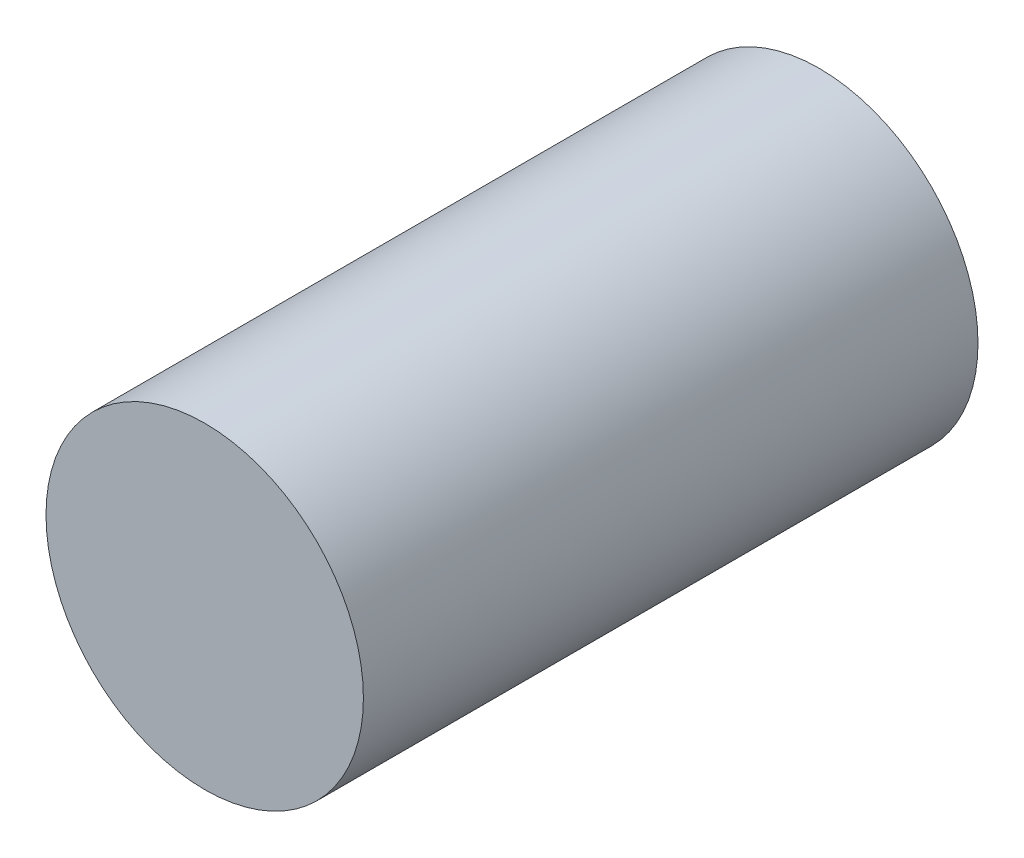
ISO-10303-21;
HEADER;
FILE_DESCRIPTION(('STEP AP214'),'2;1');
FILE_NAME('part.step','',(''),(''),'','','');
FILE_SCHEMA(('AUTOMOTIVE_DESIGN { 1 0 10303 214 1 1 1 1 }'));
ENDSEC;
DATA;
#1=APPLICATION_CONTEXT('core data for automotive mechanical design processes');
#2=APPLICATION_PROTOCOL_DEFINITION('international standard','automotive_design',2000,#1);
#3=PRODUCT_CONTEXT('',#1,'mechanical');
#4=PRODUCT('Part','Part','',(#3));
#5=PRODUCT_RELATED_PRODUCT_CATEGORY('part','',(#4));
#6=PRODUCT_DEFINITION_FORMATION('','',#4);
#7=PRODUCT_DEFINITION_CONTEXT('part definition',#1,'design');
#8=PRODUCT_DEFINITION('design','',#6,#7);
#9=PRODUCT_DEFINITION_SHAPE('','',#8);
#10=(LENGTH_UNIT() NAMED_UNIT(*) SI_UNIT(.MILLI.,.METRE.));
#11=(NAMED_UNIT(*) PLANE_ANGLE_UNIT() SI_UNIT($,.RADIAN.));
#12=(NAMED_UNIT(*) SI_UNIT($,.STERADIAN.) SOLID_ANGLE_UNIT());
#13=UNCERTAINTY_MEASURE_WITH_UNIT(LENGTH_MEASURE(1.E-05),#10,'distance_accuracy_value','');
#14=(GEOMETRIC_REPRESENTATION_CONTEXT(3) GLOBAL_UNCERTAINTY_ASSIGNED_CONTEXT((#13)) GLOBAL_UNIT_ASSIGNED_CONTEXT((#10,
#11,#12)) REPRESENTATION_CONTEXT('',''));
#15=CARTESIAN_POINT('',(0.,0.,0.));
#16=DIRECTION('',(0.,0.,1.));
#17=DIRECTION('',(1.,0.,0.));
#18=AXIS2_PLACEMENT_3D('',#15,#16,#17);
#19=CARTESIAN_POINT('',(0.,0.,15.2));
#20=DIRECTION('',(0.,0.,-1.));
#21=DIRECTION('',(-1.,0.,0.));
#22=AXIS2_PLACEMENT_3D('',#19,#20,#21);
#23=CYLINDRICAL_SURFACE('',#22,3.925);
#24=CARTESIAN_POINT('',(0.,0.,15.2));
#25=DIRECTION('',(0.,0.,1.));
#26=DIRECTION('',(1.,0.,0.));
#27=AXIS2_PLACEMENT_3D('',#24,#25,#26);
#28=CIRCLE('',#27,3.925);
#29=CARTESIAN_POINT('',(3.925,0.,15.2));
#30=VERTEX_POINT('',#29);
#31=EDGE_CURVE('E10',#30,#30,#28,.T.);
#32=ORIENTED_EDGE('',*,*,#31,.F.);
#33=EDGE_LOOP('',(#32));
#34=FACE_BOUND('',#33,.T.);
#35=CARTESIAN_POINT('',(0.,0.,0.));
#36=DIRECTION('',(0.,0.,1.));
#37=DIRECTION('',(1.,0.,0.));
#38=AXIS2_PLACEMENT_3D('',#35,#36,#37);
#39=CIRCLE('',#38,3.925);
#40=CARTESIAN_POINT('',(3.925,0.,0.));
#41=VERTEX_POINT('',#40);
#42=EDGE_CURVE('E40',#41,#41,#39,.T.);
#43=ORIENTED_EDGE('',*,*,#42,.T.);
#44=EDGE_LOOP('',(#43));
#45=FACE_BOUND('',#44,.T.);
#46=ADVANCED_FACE('F37',(#34,#45),#23,.T.);
#47=CARTESIAN_POINT('',(0.,0.,15.2));
#48=DIRECTION('',(0.,0.,1.));
#49=DIRECTION('',(1.,0.,0.));
#50=AXIS2_PLACEMENT_3D('',#47,#48,#49);
#51=PLANE('',#50);
#52=ORIENTED_EDGE('',*,*,#31,.T.);
#53=EDGE_LOOP('',(#52));
#54=FACE_BOUND('',#53,.T.);
#55=ADVANCED_FACE('F52',(#54),#51,.T.);
#56=CARTESIAN_POINT('',(0.,0.,0.));
#57=DIRECTION('',(0.,0.,1.));
#58=DIRECTION('',(1.,0.,0.));
#59=AXIS2_PLACEMENT_3D('',#56,#57,#58);
#60=PLANE('',#59);
#61=ORIENTED_EDGE('',*,*,#42,.F.);
#62=EDGE_LOOP('',(#61));
#63=FACE_BOUND('',#62,.T.);
#64=ADVANCED_FACE('F50',(#63),#60,.F.);
#65=CLOSED_SHELL('',(#46,#55,#64));
#66=MANIFOLD_SOLID_BREP('B2',#65);
#67=ADVANCED_BREP_SHAPE_REPRESENTATION('',(#18,#66),#14);
#68=SHAPE_DEFINITION_REPRESENTATION(#9,#67);
ENDSEC;
END-ISO-10303-21;
